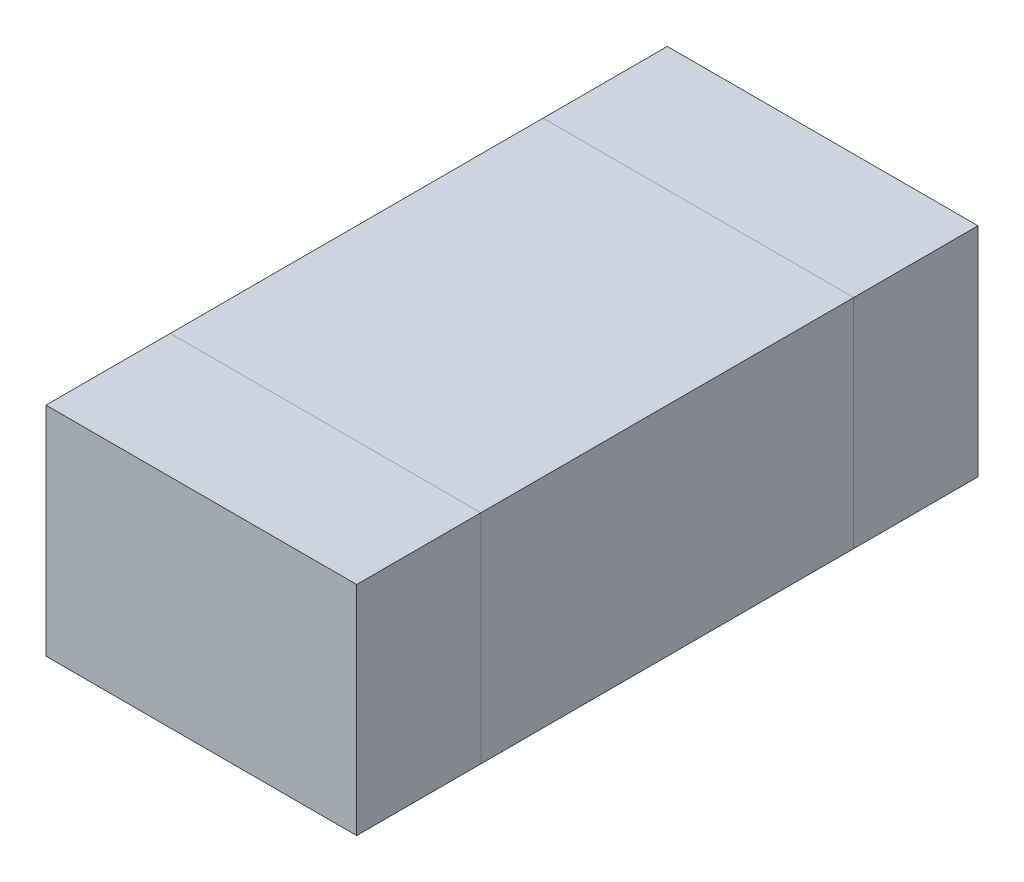
ISO-10303-21;
HEADER;
FILE_DESCRIPTION(('STEP AP214'),'2;1');
FILE_NAME('part.step','',(''),(''),'','','');
FILE_SCHEMA(('AUTOMOTIVE_DESIGN { 1 0 10303 214 1 1 1 1 }'));
ENDSEC;
DATA;
#1=APPLICATION_CONTEXT('core data for automotive mechanical design processes');
#2=APPLICATION_PROTOCOL_DEFINITION('international standard','automotive_design',2000,#1);
#3=PRODUCT_CONTEXT('',#1,'mechanical');
#4=PRODUCT('Part','Part','',(#3));
#5=PRODUCT_RELATED_PRODUCT_CATEGORY('part','',(#4));
#6=PRODUCT_DEFINITION_FORMATION('','',#4);
#7=PRODUCT_DEFINITION_CONTEXT('part definition',#1,'design');
#8=PRODUCT_DEFINITION('design','',#6,#7);
#9=PRODUCT_DEFINITION_SHAPE('','',#8);
#10=(LENGTH_UNIT() NAMED_UNIT(*) SI_UNIT(.MILLI.,.METRE.));
#11=(NAMED_UNIT(*) PLANE_ANGLE_UNIT() SI_UNIT($,.RADIAN.));
#12=(NAMED_UNIT(*) SI_UNIT($,.STERADIAN.) SOLID_ANGLE_UNIT());
#13=UNCERTAINTY_MEASURE_WITH_UNIT(LENGTH_MEASURE(1.E-05),#10,'distance_accuracy_value','');
#14=(GEOMETRIC_REPRESENTATION_CONTEXT(3) GLOBAL_UNCERTAINTY_ASSIGNED_CONTEXT((#13)) GLOBAL_UNIT_ASSIGNED_CONTEXT((#10,
#11,#12)) REPRESENTATION_CONTEXT('',''));
#15=CARTESIAN_POINT('',(0.,0.,0.));
#16=DIRECTION('',(0.,0.,1.));
#17=DIRECTION('',(1.,0.,0.));
#18=AXIS2_PLACEMENT_3D('',#15,#16,#17);
#19=CARTESIAN_POINT('',(0.,0.35,0.));
#20=DIRECTION('',(0.,1.,0.));
#21=DIRECTION('',(0.,0.,1.));
#22=AXIS2_PLACEMENT_3D('',#19,#20,#21);
#23=PLANE('',#22);
#24=DIRECTION('',(0.,0.,-1.));
#25=VECTOR('',#24,1.);
#26=CARTESIAN_POINT('',(-0.25,0.35,-0.3));
#27=LINE('',#26,#25);
#28=CARTESIAN_POINT('',(-0.25,0.35,-0.3));
#29=VERTEX_POINT('',#28);
#30=CARTESIAN_POINT('',(-0.25,0.35,-0.5));
#31=VERTEX_POINT('',#30);
#32=EDGE_CURVE('E62',#29,#31,#27,.T.);
#33=ORIENTED_EDGE('',*,*,#32,.F.);
#34=DIRECTION('',(-1.,0.,0.));
#35=VECTOR('',#34,1.);
#36=CARTESIAN_POINT('',(-0.25,0.35,-0.3));
#37=LINE('',#36,#35);
#38=CARTESIAN_POINT('',(0.25,0.35,-0.3));
#39=VERTEX_POINT('',#38);
#40=EDGE_CURVE('E85',#39,#29,#37,.T.);
#41=ORIENTED_EDGE('',*,*,#40,.F.);
#42=DIRECTION('',(0.,0.,1.));
#43=VECTOR('',#42,1.);
#44=CARTESIAN_POINT('',(0.25,0.35,-0.3));
#45=LINE('',#44,#43);
#46=CARTESIAN_POINT('',(0.25,0.35,-0.5));
#47=VERTEX_POINT('',#46);
#48=EDGE_CURVE('E90',#47,#39,#45,.T.);
#49=ORIENTED_EDGE('',*,*,#48,.F.);
#50=DIRECTION('',(1.,0.,0.));
#51=VECTOR('',#50,1.);
#52=CARTESIAN_POINT('',(-0.25,0.35,-0.5));
#53=LINE('',#52,#51);
#54=EDGE_CURVE('E105',#31,#47,#53,.T.);
#55=ORIENTED_EDGE('',*,*,#54,.F.);
#56=EDGE_LOOP('',(#33,#41,#49,#55));
#57=FACE_BOUND('',#56,.T.);
#58=ADVANCED_FACE('F54',(#57),#23,.T.);
#59=CARTESIAN_POINT('',(0.,0.,0.));
#60=DIRECTION('',(0.,-1.,0.));
#61=DIRECTION('',(0.,0.,-1.));
#62=AXIS2_PLACEMENT_3D('',#59,#60,#61);
#63=PLANE('',#62);
#64=DIRECTION('',(0.,0.,-1.));
#65=VECTOR('',#64,1.);
#66=CARTESIAN_POINT('',(-0.25,0.,-0.3));
#67=LINE('',#66,#65);
#68=CARTESIAN_POINT('',(-0.25,0.,-0.3));
#69=VERTEX_POINT('',#68);
#70=CARTESIAN_POINT('',(-0.25,0.,-0.5));
#71=VERTEX_POINT('',#70);
#72=EDGE_CURVE('E114',#69,#71,#67,.T.);
#73=ORIENTED_EDGE('',*,*,#72,.T.);
#74=DIRECTION('',(1.,0.,0.));
#75=VECTOR('',#74,1.);
#76=CARTESIAN_POINT('',(-0.25,0.,-0.5));
#77=LINE('',#76,#75);
#78=CARTESIAN_POINT('',(0.25,0.,-0.5));
#79=VERTEX_POINT('',#78);
#80=EDGE_CURVE('E103',#71,#79,#77,.T.);
#81=ORIENTED_EDGE('',*,*,#80,.T.);
#82=DIRECTION('',(0.,0.,1.));
#83=VECTOR('',#82,1.);
#84=CARTESIAN_POINT('',(0.25,0.,-0.3));
#85=LINE('',#84,#83);
#86=CARTESIAN_POINT('',(0.25,0.,-0.3));
#87=VERTEX_POINT('',#86);
#88=EDGE_CURVE('E106',#79,#87,#85,.T.);
#89=ORIENTED_EDGE('',*,*,#88,.T.);
#90=DIRECTION('',(-1.,0.,0.));
#91=VECTOR('',#90,1.);
#92=CARTESIAN_POINT('',(-0.25,0.,-0.3));
#93=LINE('',#92,#91);
#94=EDGE_CURVE('E111',#87,#69,#93,.T.);
#95=ORIENTED_EDGE('',*,*,#94,.T.);
#96=EDGE_LOOP('',(#73,#81,#89,#95));
#97=FACE_BOUND('',#96,.T.);
#98=ADVANCED_FACE('F113',(#97),#63,.T.);
#99=CARTESIAN_POINT('',(-0.25,0.888516480713451,-0.5));
#100=DIRECTION('',(0.,0.,-1.));
#101=DIRECTION('',(-1.,0.,0.));
#102=AXIS2_PLACEMENT_3D('',#99,#100,#101);
#103=PLANE('',#102);
#104=DIRECTION('',(0.,-1.,0.));
#105=VECTOR('',#104,1.);
#106=CARTESIAN_POINT('',(-0.25,0.888516480713451,-0.5));
#107=LINE('',#106,#105);
#108=EDGE_CURVE('E12',#31,#71,#107,.T.);
#109=ORIENTED_EDGE('',*,*,#108,.F.);
#110=ORIENTED_EDGE('',*,*,#54,.T.);
#111=DIRECTION('',(0.,-1.,0.));
#112=VECTOR('',#111,1.);
#113=CARTESIAN_POINT('',(0.25,0.888516480713451,-0.5));
#114=LINE('',#113,#112);
#115=EDGE_CURVE('E100',#47,#79,#114,.T.);
#116=ORIENTED_EDGE('',*,*,#115,.T.);
#117=ORIENTED_EDGE('',*,*,#80,.F.);
#118=EDGE_LOOP('',(#109,#110,#116,#117));
#119=FACE_BOUND('',#118,.T.);
#120=ADVANCED_FACE('F101',(#119),#103,.T.);
#121=CARTESIAN_POINT('',(0.25,0.888516480713451,-0.3));
#122=DIRECTION('',(1.,0.,0.));
#123=DIRECTION('',(0.,0.,-1.));
#124=AXIS2_PLACEMENT_3D('',#121,#122,#123);
#125=PLANE('',#124);
#126=ORIENTED_EDGE('',*,*,#115,.F.);
#127=ORIENTED_EDGE('',*,*,#48,.T.);
#128=DIRECTION('',(0.,-1.,0.));
#129=VECTOR('',#128,1.);
#130=CARTESIAN_POINT('',(0.25,0.888516480713451,-0.3));
#131=LINE('',#130,#129);
#132=EDGE_CURVE('E95',#39,#87,#131,.T.);
#133=ORIENTED_EDGE('',*,*,#132,.T.);
#134=ORIENTED_EDGE('',*,*,#88,.F.);
#135=EDGE_LOOP('',(#126,#127,#133,#134));
#136=FACE_BOUND('',#135,.T.);
#137=ADVANCED_FACE('F107',(#136),#125,.T.);
#138=CARTESIAN_POINT('',(-0.25,0.888516480713451,-0.3));
#139=DIRECTION('',(0.,0.,1.));
#140=DIRECTION('',(1.,0.,0.));
#141=AXIS2_PLACEMENT_3D('',#138,#139,#140);
#142=PLANE('',#141);
#143=ORIENTED_EDGE('',*,*,#132,.F.);
#144=ORIENTED_EDGE('',*,*,#40,.T.);
#145=DIRECTION('',(0.,-1.,0.));
#146=VECTOR('',#145,1.);
#147=CARTESIAN_POINT('',(-0.25,0.888516480713451,-0.3));
#148=LINE('',#147,#146);
#149=EDGE_CURVE('E121',#29,#69,#148,.T.);
#150=ORIENTED_EDGE('',*,*,#149,.T.);
#151=ORIENTED_EDGE('',*,*,#94,.F.);
#152=EDGE_LOOP('',(#143,#144,#150,#151));
#153=FACE_BOUND('',#152,.T.);
#154=ADVANCED_FACE('F127',(#153),#142,.T.);
#155=CARTESIAN_POINT('',(-0.25,0.888516480713451,-0.3));
#156=DIRECTION('',(-1.,0.,0.));
#157=DIRECTION('',(0.,0.,1.));
#158=AXIS2_PLACEMENT_3D('',#155,#156,#157);
#159=PLANE('',#158);
#160=ORIENTED_EDGE('',*,*,#149,.F.);
#161=ORIENTED_EDGE('',*,*,#32,.T.);
#162=ORIENTED_EDGE('',*,*,#108,.T.);
#163=ORIENTED_EDGE('',*,*,#72,.F.);
#164=EDGE_LOOP('',(#160,#161,#162,#163));
#165=FACE_BOUND('',#164,.T.);
#166=ADVANCED_FACE('F128',(#165),#159,.T.);
#167=CLOSED_SHELL('',(#58,#98,#120,#137,#154,#166));
#168=MANIFOLD_SOLID_BREP('B2',#167);
#169=CARTESIAN_POINT('',(0.,0.35,0.));
#170=DIRECTION('',(0.,1.,0.));
#171=DIRECTION('',(0.,0.,1.));
#172=AXIS2_PLACEMENT_3D('',#169,#170,#171);
#173=PLANE('',#172);
#174=DIRECTION('',(0.,0.,-1.));
#175=VECTOR('',#174,1.);
#176=CARTESIAN_POINT('',(-0.25,0.35,0.3));
#177=LINE('',#176,#175);
#178=CARTESIAN_POINT('',(-0.25,0.35,0.5));
#179=VERTEX_POINT('',#178);
#180=CARTESIAN_POINT('',(-0.25,0.35,0.3));
#181=VERTEX_POINT('',#180);
#182=EDGE_CURVE('E183',#179,#181,#177,.T.);
#183=ORIENTED_EDGE('',*,*,#182,.F.);
#184=DIRECTION('',(-1.,0.,0.));
#185=VECTOR('',#184,1.);
#186=CARTESIAN_POINT('',(-0.25,0.35,0.5));
#187=LINE('',#186,#185);
#188=CARTESIAN_POINT('',(0.25,0.35,0.5));
#189=VERTEX_POINT('',#188);
#190=EDGE_CURVE('E206',#189,#179,#187,.T.);
#191=ORIENTED_EDGE('',*,*,#190,.F.);
#192=DIRECTION('',(0.,0.,1.));
#193=VECTOR('',#192,1.);
#194=CARTESIAN_POINT('',(0.25,0.35,0.3));
#195=LINE('',#194,#193);
#196=CARTESIAN_POINT('',(0.25,0.35,0.3));
#197=VERTEX_POINT('',#196);
#198=EDGE_CURVE('E211',#197,#189,#195,.T.);
#199=ORIENTED_EDGE('',*,*,#198,.F.);
#200=DIRECTION('',(1.,0.,0.));
#201=VECTOR('',#200,1.);
#202=CARTESIAN_POINT('',(-0.25,0.35,0.3));
#203=LINE('',#202,#201);
#204=EDGE_CURVE('E226',#181,#197,#203,.T.);
#205=ORIENTED_EDGE('',*,*,#204,.F.);
#206=EDGE_LOOP('',(#183,#191,#199,#205));
#207=FACE_BOUND('',#206,.T.);
#208=ADVANCED_FACE('F175',(#207),#173,.T.);
#209=CARTESIAN_POINT('',(0.,0.,0.));
#210=DIRECTION('',(0.,1.,0.));
#211=DIRECTION('',(0.,0.,1.));
#212=AXIS2_PLACEMENT_3D('',#209,#210,#211);
#213=PLANE('',#212);
#214=DIRECTION('',(0.,0.,-1.));
#215=VECTOR('',#214,1.);
#216=CARTESIAN_POINT('',(-0.25,0.,0.3));
#217=LINE('',#216,#215);
#218=CARTESIAN_POINT('',(-0.25,0.,0.5));
#219=VERTEX_POINT('',#218);
#220=CARTESIAN_POINT('',(-0.25,0.,0.3));
#221=VERTEX_POINT('',#220);
#222=EDGE_CURVE('E235',#219,#221,#217,.T.);
#223=ORIENTED_EDGE('',*,*,#222,.T.);
#224=DIRECTION('',(1.,0.,0.));
#225=VECTOR('',#224,1.);
#226=CARTESIAN_POINT('',(-0.25,0.,0.3));
#227=LINE('',#226,#225);
#228=CARTESIAN_POINT('',(0.25,0.,0.3));
#229=VERTEX_POINT('',#228);
#230=EDGE_CURVE('E224',#221,#229,#227,.T.);
#231=ORIENTED_EDGE('',*,*,#230,.T.);
#232=DIRECTION('',(0.,0.,1.));
#233=VECTOR('',#232,1.);
#234=CARTESIAN_POINT('',(0.25,0.,0.3));
#235=LINE('',#234,#233);
#236=CARTESIAN_POINT('',(0.25,0.,0.5));
#237=VERTEX_POINT('',#236);
#238=EDGE_CURVE('E227',#229,#237,#235,.T.);
#239=ORIENTED_EDGE('',*,*,#238,.T.);
#240=DIRECTION('',(-1.,0.,0.));
#241=VECTOR('',#240,1.);
#242=CARTESIAN_POINT('',(-0.25,0.,0.5));
#243=LINE('',#242,#241);
#244=EDGE_CURVE('E232',#237,#219,#243,.T.);
#245=ORIENTED_EDGE('',*,*,#244,.T.);
#246=EDGE_LOOP('',(#223,#231,#239,#245));
#247=FACE_BOUND('',#246,.T.);
#248=ADVANCED_FACE('F234',(#247),#213,.F.);
#249=CARTESIAN_POINT('',(-0.25,0.88851648071345,0.3));
#250=DIRECTION('',(0.,0.,-1.));
#251=DIRECTION('',(-1.,0.,0.));
#252=AXIS2_PLACEMENT_3D('',#249,#250,#251);
#253=PLANE('',#252);
#254=DIRECTION('',(0.,-1.,0.));
#255=VECTOR('',#254,1.);
#256=CARTESIAN_POINT('',(-0.25,0.88851648071345,0.3));
#257=LINE('',#256,#255);
#258=EDGE_CURVE('E52',#181,#221,#257,.T.);
#259=ORIENTED_EDGE('',*,*,#258,.F.);
#260=ORIENTED_EDGE('',*,*,#204,.T.);
#261=DIRECTION('',(0.,-1.,0.));
#262=VECTOR('',#261,1.);
#263=CARTESIAN_POINT('',(0.25,0.88851648071345,0.3));
#264=LINE('',#263,#262);
#265=EDGE_CURVE('E221',#197,#229,#264,.T.);
#266=ORIENTED_EDGE('',*,*,#265,.T.);
#267=ORIENTED_EDGE('',*,*,#230,.F.);
#268=EDGE_LOOP('',(#259,#260,#266,#267));
#269=FACE_BOUND('',#268,.T.);
#270=ADVANCED_FACE('F222',(#269),#253,.T.);
#271=CARTESIAN_POINT('',(0.25,0.88851648071345,0.3));
#272=DIRECTION('',(1.,0.,0.));
#273=DIRECTION('',(0.,0.,-1.));
#274=AXIS2_PLACEMENT_3D('',#271,#272,#273);
#275=PLANE('',#274);
#276=ORIENTED_EDGE('',*,*,#265,.F.);
#277=ORIENTED_EDGE('',*,*,#198,.T.);
#278=DIRECTION('',(0.,-1.,0.));
#279=VECTOR('',#278,1.);
#280=CARTESIAN_POINT('',(0.25,0.88851648071345,0.5));
#281=LINE('',#280,#279);
#282=EDGE_CURVE('E216',#189,#237,#281,.T.);
#283=ORIENTED_EDGE('',*,*,#282,.T.);
#284=ORIENTED_EDGE('',*,*,#238,.F.);
#285=EDGE_LOOP('',(#276,#277,#283,#284));
#286=FACE_BOUND('',#285,.T.);
#287=ADVANCED_FACE('F228',(#286),#275,.T.);
#288=CARTESIAN_POINT('',(-0.25,0.88851648071345,0.5));
#289=DIRECTION('',(0.,0.,1.));
#290=DIRECTION('',(1.,0.,0.));
#291=AXIS2_PLACEMENT_3D('',#288,#289,#290);
#292=PLANE('',#291);
#293=ORIENTED_EDGE('',*,*,#282,.F.);
#294=ORIENTED_EDGE('',*,*,#190,.T.);
#295=DIRECTION('',(0.,-1.,0.));
#296=VECTOR('',#295,1.);
#297=CARTESIAN_POINT('',(-0.25,0.88851648071345,0.5));
#298=LINE('',#297,#296);
#299=EDGE_CURVE('E242',#179,#219,#298,.T.);
#300=ORIENTED_EDGE('',*,*,#299,.T.);
#301=ORIENTED_EDGE('',*,*,#244,.F.);
#302=EDGE_LOOP('',(#293,#294,#300,#301));
#303=FACE_BOUND('',#302,.T.);
#304=ADVANCED_FACE('F248',(#303),#292,.T.);
#305=CARTESIAN_POINT('',(-0.25,0.88851648071345,0.3));
#306=DIRECTION('',(-1.,0.,0.));
#307=DIRECTION('',(0.,0.,1.));
#308=AXIS2_PLACEMENT_3D('',#305,#306,#307);
#309=PLANE('',#308);
#310=ORIENTED_EDGE('',*,*,#299,.F.);
#311=ORIENTED_EDGE('',*,*,#182,.T.);
#312=ORIENTED_EDGE('',*,*,#258,.T.);
#313=ORIENTED_EDGE('',*,*,#222,.F.);
#314=EDGE_LOOP('',(#310,#311,#312,#313));
#315=FACE_BOUND('',#314,.T.);
#316=ADVANCED_FACE('F249',(#315),#309,.T.);
#317=CLOSED_SHELL('',(#208,#248,#270,#287,#304,#316));
#318=MANIFOLD_SOLID_BREP('B6',#317);
#319=CARTESIAN_POINT('',(0.25,0.35,-0.3));
#320=DIRECTION('',(-1.,0.,0.));
#321=DIRECTION('',(0.,0.,1.));
#322=AXIS2_PLACEMENT_3D('',#319,#320,#321);
#323=PLANE('',#322);
#324=DIRECTION('',(0.,0.,-1.));
#325=VECTOR('',#324,1.);
#326=CARTESIAN_POINT('',(0.25,0.,-0.3));
#327=LINE('',#326,#325);
#328=CARTESIAN_POINT('',(0.25,0.,0.3));
#329=VERTEX_POINT('',#328);
#330=CARTESIAN_POINT('',(0.25,0.,-0.3));
#331=VERTEX_POINT('',#330);
#332=EDGE_CURVE('E350',#329,#331,#327,.T.);
#333=ORIENTED_EDGE('',*,*,#332,.T.);
#334=DIRECTION('',(0.,-1.,0.));
#335=VECTOR('',#334,1.);
#336=CARTESIAN_POINT('',(0.25,0.35,-0.3));
#337=LINE('',#336,#335);
#338=CARTESIAN_POINT('',(0.25,0.35,-0.3));
#339=VERTEX_POINT('',#338);
#340=EDGE_CURVE('E173',#339,#331,#337,.T.);
#341=ORIENTED_EDGE('',*,*,#340,.F.);
#342=DIRECTION('',(0.,0.,-1.));
#343=VECTOR('',#342,1.);
#344=CARTESIAN_POINT('',(0.25,0.35,-0.3));
#345=LINE('',#344,#343);
#346=CARTESIAN_POINT('',(0.25,0.35,0.3));
#347=VERTEX_POINT('',#346);
#348=EDGE_CURVE('E338',#347,#339,#345,.T.);
#349=ORIENTED_EDGE('',*,*,#348,.F.);
#350=DIRECTION('',(0.,-1.,0.));
#351=VECTOR('',#350,1.);
#352=CARTESIAN_POINT('',(0.25,0.35,0.3));
#353=LINE('',#352,#351);
#354=EDGE_CURVE('E346',#347,#329,#353,.T.);
#355=ORIENTED_EDGE('',*,*,#354,.T.);
#356=EDGE_LOOP('',(#333,#341,#349,#355));
#357=FACE_BOUND('',#356,.T.);
#358=ADVANCED_FACE('F287',(#357),#323,.F.);
#359=CARTESIAN_POINT('',(-0.25,0.35,-0.3));
#360=DIRECTION('',(0.,0.,1.));
#361=DIRECTION('',(1.,0.,0.));
#362=AXIS2_PLACEMENT_3D('',#359,#360,#361);
#363=PLANE('',#362);
#364=DIRECTION('',(-1.,0.,0.));
#365=VECTOR('',#364,1.);
#366=CARTESIAN_POINT('',(-0.25,0.,-0.3));
#367=LINE('',#366,#365);
#368=CARTESIAN_POINT('',(-0.25,0.,-0.3));
#369=VERTEX_POINT('',#368);
#370=EDGE_CURVE('E342',#331,#369,#367,.T.);
#371=ORIENTED_EDGE('',*,*,#370,.T.);
#372=DIRECTION('',(0.,-1.,0.));
#373=VECTOR('',#372,1.);
#374=CARTESIAN_POINT('',(-0.25,0.35,-0.3));
#375=LINE('',#374,#373);
#376=CARTESIAN_POINT('',(-0.25,0.35,-0.3));
#377=VERTEX_POINT('',#376);
#378=EDGE_CURVE('E295',#377,#369,#375,.T.);
#379=ORIENTED_EDGE('',*,*,#378,.F.);
#380=DIRECTION('',(-1.,0.,0.));
#381=VECTOR('',#380,1.);
#382=CARTESIAN_POINT('',(-0.25,0.35,-0.3));
#383=LINE('',#382,#381);
#384=EDGE_CURVE('E333',#339,#377,#383,.T.);
#385=ORIENTED_EDGE('',*,*,#384,.F.);
#386=ORIENTED_EDGE('',*,*,#340,.T.);
#387=EDGE_LOOP('',(#371,#379,#385,#386));
#388=FACE_BOUND('',#387,.T.);
#389=ADVANCED_FACE('F341',(#388),#363,.F.);
#390=CARTESIAN_POINT('',(-0.25,0.35,-0.3));
#391=DIRECTION('',(1.,0.,0.));
#392=DIRECTION('',(0.,0.,-1.));
#393=AXIS2_PLACEMENT_3D('',#390,#391,#392);
#394=PLANE('',#393);
#395=DIRECTION('',(0.,0.,1.));
#396=VECTOR('',#395,1.);
#397=CARTESIAN_POINT('',(-0.25,0.,-0.3));
#398=LINE('',#397,#396);
#399=CARTESIAN_POINT('',(-0.25,0.,0.3));
#400=VERTEX_POINT('',#399);
#401=EDGE_CURVE('E320',#369,#400,#398,.T.);
#402=ORIENTED_EDGE('',*,*,#401,.T.);
#403=DIRECTION('',(0.,-1.,0.));
#404=VECTOR('',#403,1.);
#405=CARTESIAN_POINT('',(-0.25,0.35,0.3));
#406=LINE('',#405,#404);
#407=CARTESIAN_POINT('',(-0.25,0.35,0.3));
#408=VERTEX_POINT('',#407);
#409=EDGE_CURVE('E343',#408,#400,#406,.T.);
#410=ORIENTED_EDGE('',*,*,#409,.F.);
#411=DIRECTION('',(0.,0.,1.));
#412=VECTOR('',#411,1.);
#413=CARTESIAN_POINT('',(-0.25,0.35,-0.3));
#414=LINE('',#413,#412);
#415=EDGE_CURVE('E336',#377,#408,#414,.T.);
#416=ORIENTED_EDGE('',*,*,#415,.F.);
#417=ORIENTED_EDGE('',*,*,#378,.T.);
#418=EDGE_LOOP('',(#402,#410,#416,#417));
#419=FACE_BOUND('',#418,.T.);
#420=ADVANCED_FACE('F344',(#419),#394,.F.);
#421=CARTESIAN_POINT('',(-0.25,0.35,0.3));
#422=DIRECTION('',(0.,0.,-1.));
#423=DIRECTION('',(-1.,0.,0.));
#424=AXIS2_PLACEMENT_3D('',#421,#422,#423);
#425=PLANE('',#424);
#426=DIRECTION('',(1.,0.,0.));
#427=VECTOR('',#426,1.);
#428=CARTESIAN_POINT('',(-0.25,0.,0.3));
#429=LINE('',#428,#427);
#430=EDGE_CURVE('E326',#400,#329,#429,.T.);
#431=ORIENTED_EDGE('',*,*,#430,.T.);
#432=ORIENTED_EDGE('',*,*,#354,.F.);
#433=DIRECTION('',(1.,0.,0.));
#434=VECTOR('',#433,1.);
#435=CARTESIAN_POINT('',(-0.25,0.35,0.3));
#436=LINE('',#435,#434);
#437=EDGE_CURVE('E303',#408,#347,#436,.T.);
#438=ORIENTED_EDGE('',*,*,#437,.F.);
#439=ORIENTED_EDGE('',*,*,#409,.T.);
#440=EDGE_LOOP('',(#431,#432,#438,#439));
#441=FACE_BOUND('',#440,.T.);
#442=ADVANCED_FACE('F357',(#441),#425,.F.);
#443=CARTESIAN_POINT('',(0.,0.35,0.));
#444=DIRECTION('',(0.,1.,0.));
#445=DIRECTION('',(0.,0.,1.));
#446=AXIS2_PLACEMENT_3D('',#443,#444,#445);
#447=PLANE('',#446);
#448=ORIENTED_EDGE('',*,*,#348,.T.);
#449=ORIENTED_EDGE('',*,*,#384,.T.);
#450=ORIENTED_EDGE('',*,*,#415,.T.);
#451=ORIENTED_EDGE('',*,*,#437,.T.);
#452=EDGE_LOOP('',(#448,#449,#450,#451));
#453=FACE_BOUND('',#452,.T.);
#454=ADVANCED_FACE('F334',(#453),#447,.T.);
#455=CARTESIAN_POINT('',(0.,0.,0.));
#456=DIRECTION('',(0.,1.,0.));
#457=DIRECTION('',(0.,0.,1.));
#458=AXIS2_PLACEMENT_3D('',#455,#456,#457);
#459=PLANE('',#458);
#460=ORIENTED_EDGE('',*,*,#332,.F.);
#461=ORIENTED_EDGE('',*,*,#430,.F.);
#462=ORIENTED_EDGE('',*,*,#401,.F.);
#463=ORIENTED_EDGE('',*,*,#370,.F.);
#464=EDGE_LOOP('',(#460,#461,#462,#463));
#465=FACE_BOUND('',#464,.T.);
#466=ADVANCED_FACE('F360',(#465),#459,.F.);
#467=CLOSED_SHELL('',(#358,#389,#420,#442,#454,#466));
#468=MANIFOLD_SOLID_BREP('B46',#467);
#469=ADVANCED_BREP_SHAPE_REPRESENTATION('',(#18,#168,#318,#468),#14);
#470=SHAPE_DEFINITION_REPRESENTATION(#9,#469);
ENDSEC;
END-ISO-10303-21;
